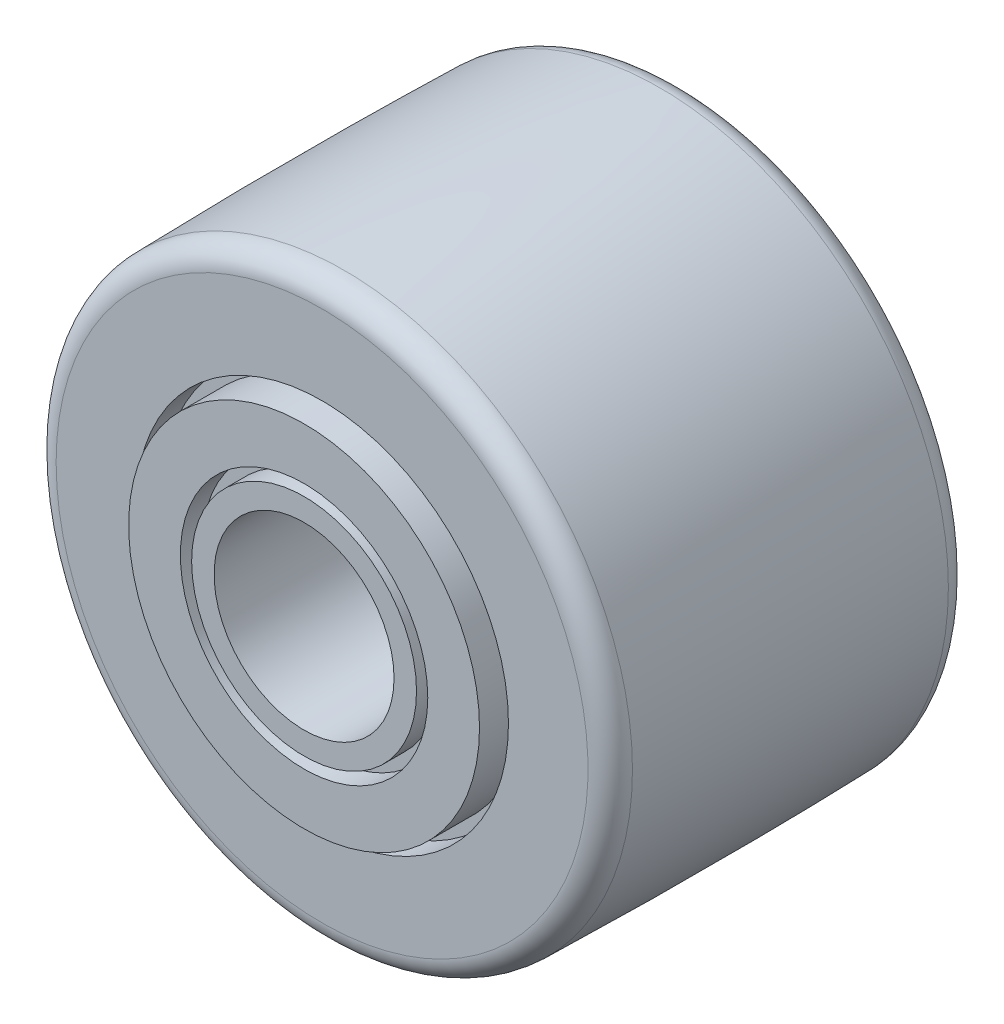
ISO-10303-21;
HEADER;
FILE_DESCRIPTION(('STEP AP214'),'2;1');
FILE_NAME('part.step','',(''),(''),'','','');
FILE_SCHEMA(('AUTOMOTIVE_DESIGN { 1 0 10303 214 1 1 1 1 }'));
ENDSEC;
DATA;
#1=APPLICATION_CONTEXT('core data for automotive mechanical design processes');
#2=APPLICATION_PROTOCOL_DEFINITION('international standard','automotive_design',2000,#1);
#3=PRODUCT_CONTEXT('',#1,'mechanical');
#4=PRODUCT('Part','Part','',(#3));
#5=PRODUCT_RELATED_PRODUCT_CATEGORY('part','',(#4));
#6=PRODUCT_DEFINITION_FORMATION('','',#4);
#7=PRODUCT_DEFINITION_CONTEXT('part definition',#1,'design');
#8=PRODUCT_DEFINITION('design','',#6,#7);
#9=PRODUCT_DEFINITION_SHAPE('','',#8);
#10=(LENGTH_UNIT() NAMED_UNIT(*) SI_UNIT(.MILLI.,.METRE.));
#11=(NAMED_UNIT(*) PLANE_ANGLE_UNIT() SI_UNIT($,.RADIAN.));
#12=(NAMED_UNIT(*) SI_UNIT($,.STERADIAN.) SOLID_ANGLE_UNIT());
#13=UNCERTAINTY_MEASURE_WITH_UNIT(LENGTH_MEASURE(1.E-05),#10,'distance_accuracy_value','');
#14=(GEOMETRIC_REPRESENTATION_CONTEXT(3) GLOBAL_UNCERTAINTY_ASSIGNED_CONTEXT((#13)) GLOBAL_UNIT_ASSIGNED_CONTEXT((#10,
#11,#12)) REPRESENTATION_CONTEXT('',''));
#15=CARTESIAN_POINT('',(0.,0.,0.));
#16=DIRECTION('',(0.,0.,1.));
#17=DIRECTION('',(1.,0.,0.));
#18=AXIS2_PLACEMENT_3D('',#15,#16,#17);
#19=CARTESIAN_POINT('',(0.,-12.7,-16.66875));
#20=DIRECTION('',(0.,0.,1.));
#21=DIRECTION('',(1.,0.,0.));
#22=AXIS2_PLACEMENT_3D('',#19,#20,#21);
#23=PLANE('',#22);
#24=CARTESIAN_POINT('',(0.,0.,-16.66875));
#25=DIRECTION('',(0.,0.,1.));
#26=DIRECTION('',(1.,0.,0.));
#27=AXIS2_PLACEMENT_3D('',#24,#25,#26);
#28=CIRCLE('',#27,11.7317845567516);
#29=CARTESIAN_POINT('',(11.7317845567516,0.,-16.66875));
#30=VERTEX_POINT('',#29);
#31=EDGE_CURVE('E43',#30,#30,#28,.F.);
#32=ORIENTED_EDGE('',*,*,#31,.T.);
#33=EDGE_LOOP('',(#32));
#34=FACE_BOUND('',#33,.T.);
#35=CARTESIAN_POINT('',(0.,0.,-16.66875));
#36=DIRECTION('',(0.,0.,1.));
#37=DIRECTION('',(1.,0.,0.));
#38=AXIS2_PLACEMENT_3D('',#35,#36,#37);
#39=CIRCLE('',#38,8.22275390625);
#40=CARTESIAN_POINT('',(8.22275390625,0.,-16.66875));
#41=VERTEX_POINT('',#40);
#42=EDGE_CURVE('E102',#41,#41,#39,.T.);
#43=ORIENTED_EDGE('',*,*,#42,.T.);
#44=EDGE_LOOP('',(#43));
#45=FACE_BOUND('',#44,.T.);
#46=ADVANCED_FACE('F36',(#34,#45),#23,.F.);
#47=CARTESIAN_POINT('',(0.,-7.7390625,-17.4625));
#48=DIRECTION('',(0.,0.,1.));
#49=DIRECTION('',(1.,0.,0.));
#50=AXIS2_PLACEMENT_3D('',#47,#48,#49);
#51=PLANE('',#50);
#52=CARTESIAN_POINT('',(0.,0.,-17.4625));
#53=DIRECTION('',(0.,0.,1.));
#54=DIRECTION('',(1.,0.,0.));
#55=AXIS2_PLACEMENT_3D('',#52,#53,#54);
#56=CIRCLE('',#55,7.7390625);
#57=CARTESIAN_POINT('',(7.7390625,0.,-17.4625));
#58=VERTEX_POINT('',#57);
#59=EDGE_CURVE('E59',#58,#58,#56,.T.);
#60=ORIENTED_EDGE('',*,*,#59,.F.);
#61=EDGE_LOOP('',(#60));
#62=FACE_BOUND('',#61,.T.);
#63=CARTESIAN_POINT('',(0.,0.,-17.4625));
#64=DIRECTION('',(0.,0.,1.));
#65=DIRECTION('',(1.,0.,0.));
#66=AXIS2_PLACEMENT_3D('',#63,#64,#65);
#67=CIRCLE('',#66,5.45703125);
#68=CARTESIAN_POINT('',(5.45703125,0.,-17.4625));
#69=VERTEX_POINT('',#68);
#70=EDGE_CURVE('E90',#69,#69,#67,.T.);
#71=ORIENTED_EDGE('',*,*,#70,.T.);
#72=EDGE_LOOP('',(#71));
#73=FACE_BOUND('',#72,.T.);
#74=ADVANCED_FACE('F131',(#62,#73),#51,.F.);
#75=CARTESIAN_POINT('',(0.,-7.7390625,0.));
#76=DIRECTION('',(0.,0.,-1.));
#77=DIRECTION('',(-1.,0.,0.));
#78=AXIS2_PLACEMENT_3D('',#75,#76,#77);
#79=PLANE('',#78);
#80=CARTESIAN_POINT('',(0.,0.,0.));
#81=DIRECTION('',(0.,0.,1.));
#82=DIRECTION('',(1.,0.,0.));
#83=AXIS2_PLACEMENT_3D('',#80,#81,#82);
#84=CIRCLE('',#83,3.96875);
#85=CARTESIAN_POINT('',(3.96875,0.,0.));
#86=VERTEX_POINT('',#85);
#87=EDGE_CURVE('E63',#86,#86,#84,.T.);
#88=ORIENTED_EDGE('',*,*,#87,.F.);
#89=EDGE_LOOP('',(#88));
#90=FACE_BOUND('',#89,.T.);
#91=CARTESIAN_POINT('',(0.,0.,0.));
#92=DIRECTION('',(0.,0.,1.));
#93=DIRECTION('',(1.,0.,0.));
#94=AXIS2_PLACEMENT_3D('',#91,#92,#93);
#95=CIRCLE('',#94,4.9609375);
#96=CARTESIAN_POINT('',(4.9609375,0.,0.));
#97=VERTEX_POINT('',#96);
#98=EDGE_CURVE('E75',#97,#97,#95,.T.);
#99=ORIENTED_EDGE('',*,*,#98,.T.);
#100=EDGE_LOOP('',(#99));
#101=FACE_BOUND('',#100,.T.);
#102=ADVANCED_FACE('F135',(#90,#101),#79,.F.);
#103=CARTESIAN_POINT('',(0.,0.,-17.4625));
#104=DIRECTION('',(0.,0.,1.));
#105=DIRECTION('',(1.,0.,0.));
#106=AXIS2_PLACEMENT_3D('',#103,#104,#105);
#107=CIRCLE('',#106,4.9609375);
#108=CARTESIAN_POINT('',(4.9609375,0.,-17.4625));
#109=VERTEX_POINT('',#108);
#110=EDGE_CURVE('E96',#109,#109,#107,.T.);
#111=ORIENTED_EDGE('',*,*,#110,.F.);
#112=EDGE_LOOP('',(#111));
#113=FACE_BOUND('',#112,.T.);
#114=CARTESIAN_POINT('',(0.,0.,-17.4625));
#115=DIRECTION('',(0.,0.,1.));
#116=DIRECTION('',(1.,0.,0.));
#117=AXIS2_PLACEMENT_3D('',#114,#115,#116);
#118=CIRCLE('',#117,3.96875);
#119=CARTESIAN_POINT('',(3.96875,0.,-17.4625));
#120=VERTEX_POINT('',#119);
#121=EDGE_CURVE('E62',#120,#120,#118,.T.);
#122=ORIENTED_EDGE('',*,*,#121,.T.);
#123=EDGE_LOOP('',(#122));
#124=FACE_BOUND('',#123,.T.);
#125=ADVANCED_FACE('F138',(#113,#124),#51,.F.);
#126=CARTESIAN_POINT('',(0.,0.,0.));
#127=DIRECTION('',(0.,0.,1.));
#128=DIRECTION('',(1.,0.,0.));
#129=AXIS2_PLACEMENT_3D('',#126,#127,#128);
#130=CIRCLE('',#129,5.45703125);
#131=CARTESIAN_POINT('',(5.45703125,0.,0.));
#132=VERTEX_POINT('',#131);
#133=EDGE_CURVE('E69',#132,#132,#130,.T.);
#134=ORIENTED_EDGE('',*,*,#133,.F.);
#135=EDGE_LOOP('',(#134));
#136=FACE_BOUND('',#135,.T.);
#137=CARTESIAN_POINT('',(0.,0.,0.));
#138=DIRECTION('',(0.,0.,1.));
#139=DIRECTION('',(1.,0.,0.));
#140=AXIS2_PLACEMENT_3D('',#137,#138,#139);
#141=CIRCLE('',#140,7.7390625);
#142=CARTESIAN_POINT('',(7.7390625,0.,0.));
#143=VERTEX_POINT('',#142);
#144=EDGE_CURVE('E56',#143,#143,#141,.T.);
#145=ORIENTED_EDGE('',*,*,#144,.T.);
#146=EDGE_LOOP('',(#145));
#147=FACE_BOUND('',#146,.T.);
#148=ADVANCED_FACE('F146',(#136,#147),#79,.F.);
#149=CARTESIAN_POINT('',(0.,0.,0.));
#150=DIRECTION('',(0.,0.,1.));
#151=DIRECTION('',(1.,0.,0.));
#152=AXIS2_PLACEMENT_3D('',#149,#150,#151);
#153=CYLINDRICAL_SURFACE('',#152,7.7390625);
#154=ORIENTED_EDGE('',*,*,#144,.F.);
#155=EDGE_LOOP('',(#154));
#156=FACE_BOUND('',#155,.T.);
#157=CARTESIAN_POINT('',(0.,0.,-1.984375));
#158=DIRECTION('',(0.,0.,1.));
#159=DIRECTION('',(1.,0.,0.));
#160=AXIS2_PLACEMENT_3D('',#157,#158,#159);
#161=CIRCLE('',#160,7.7390625);
#162=CARTESIAN_POINT('',(7.7390625,0.,-1.984375));
#163=VERTEX_POINT('',#162);
#164=EDGE_CURVE('E84',#163,#163,#161,.T.);
#165=ORIENTED_EDGE('',*,*,#164,.T.);
#166=EDGE_LOOP('',(#165));
#167=FACE_BOUND('',#166,.T.);
#168=ADVANCED_FACE('F143',(#156,#167),#153,.T.);
#169=CARTESIAN_POINT('',(0.,-12.7,-0.793750000000003));
#170=DIRECTION('',(0.,0.,-1.));
#171=DIRECTION('',(-1.,0.,0.));
#172=AXIS2_PLACEMENT_3D('',#169,#170,#171);
#173=PLANE('',#172);
#174=CARTESIAN_POINT('',(0.,0.,-0.793750000000003));
#175=DIRECTION('',(0.,0.,-1.));
#176=DIRECTION('',(-1.,0.,0.));
#177=AXIS2_PLACEMENT_3D('',#174,#175,#176);
#178=CIRCLE('',#177,11.7317845567516);
#179=CARTESIAN_POINT('',(-11.7317845567516,0.,-0.793750000000003));
#180=VERTEX_POINT('',#179);
#181=EDGE_CURVE('E10',#180,#180,#178,.F.);
#182=ORIENTED_EDGE('',*,*,#181,.T.);
#183=EDGE_LOOP('',(#182));
#184=FACE_BOUND('',#183,.T.);
#185=CARTESIAN_POINT('',(0.,0.,-0.793750000000003));
#186=DIRECTION('',(0.,0.,1.));
#187=DIRECTION('',(1.,0.,0.));
#188=AXIS2_PLACEMENT_3D('',#185,#186,#187);
#189=CIRCLE('',#188,8.22275390625);
#190=CARTESIAN_POINT('',(8.22275390625,0.,-0.793750000000003));
#191=VERTEX_POINT('',#190);
#192=EDGE_CURVE('E81',#191,#191,#189,.T.);
#193=ORIENTED_EDGE('',*,*,#192,.F.);
#194=EDGE_LOOP('',(#193));
#195=FACE_BOUND('',#194,.T.);
#196=ADVANCED_FACE('F126',(#184,#195),#173,.F.);
#197=CARTESIAN_POINT('',(0.,0.,-8.73125));
#198=DIRECTION('',(0.,0.,1.));
#199=DIRECTION('',(1.,0.,0.));
#200=AXIS2_PLACEMENT_3D('',#197,#198,#199);
#201=DEGENERATE_TOROIDAL_SURFACE('',#200,291.996629606811,304.8,.F.);
#202=CARTESIAN_POINT('',(0.,0.,-15.6992447746571));
#203=DIRECTION('',(0.,0.,1.));
#204=DIRECTION('',(1.,0.,0.));
#205=AXIS2_PLACEMENT_3D('',#202,#203,#204);
#206=CIRCLE('',#205,12.7237127545425);
#207=CARTESIAN_POINT('',(12.7237127545425,0.,-15.6992447746571));
#208=VERTEX_POINT('',#207);
#209=EDGE_CURVE('E47',#208,#208,#206,.T.);
#210=ORIENTED_EDGE('',*,*,#209,.T.);
#211=EDGE_LOOP('',(#210));
#212=FACE_BOUND('',#211,.T.);
#213=CARTESIAN_POINT('',(0.,0.,-1.76325522534292));
#214=DIRECTION('',(0.,0.,-1.));
#215=DIRECTION('',(-1.,0.,0.));
#216=AXIS2_PLACEMENT_3D('',#213,#214,#215);
#217=CIRCLE('',#216,12.7237127545425);
#218=CARTESIAN_POINT('',(-12.7237127545425,0.,-1.76325522534292));
#219=VERTEX_POINT('',#218);
#220=EDGE_CURVE('E51',#219,#219,#217,.T.);
#221=ORIENTED_EDGE('',*,*,#220,.T.);
#222=EDGE_LOOP('',(#221));
#223=FACE_BOUND('',#222,.T.);
#224=ADVANCED_FACE('F116',(#212,#223),#201,.F.);
#225=CARTESIAN_POINT('',(0.,0.,0.));
#226=DIRECTION('',(0.,0.,1.));
#227=DIRECTION('',(1.,0.,0.));
#228=AXIS2_PLACEMENT_3D('',#225,#226,#227);
#229=CYLINDRICAL_SURFACE('',#228,7.7390625);
#230=ORIENTED_EDGE('',*,*,#59,.T.);
#231=EDGE_LOOP('',(#230));
#232=FACE_BOUND('',#231,.T.);
#233=CARTESIAN_POINT('',(0.,0.,-15.478125));
#234=DIRECTION('',(0.,0.,1.));
#235=DIRECTION('',(1.,0.,0.));
#236=AXIS2_PLACEMENT_3D('',#233,#234,#235);
#237=CIRCLE('',#236,7.7390625);
#238=CARTESIAN_POINT('',(7.7390625,0.,-15.478125));
#239=VERTEX_POINT('',#238);
#240=EDGE_CURVE('E105',#239,#239,#237,.T.);
#241=ORIENTED_EDGE('',*,*,#240,.F.);
#242=EDGE_LOOP('',(#241));
#243=FACE_BOUND('',#242,.T.);
#244=ADVANCED_FACE('F113',(#232,#243),#229,.T.);
#245=CARTESIAN_POINT('',(0.,0.,-17.4625));
#246=DIRECTION('',(0.,0.,1.));
#247=DIRECTION('',(1.,0.,0.));
#248=AXIS2_PLACEMENT_3D('',#245,#246,#247);
#249=CYLINDRICAL_SURFACE('',#248,3.96875);
#250=ORIENTED_EDGE('',*,*,#121,.F.);
#251=EDGE_LOOP('',(#250));
#252=FACE_BOUND('',#251,.T.);
#253=ORIENTED_EDGE('',*,*,#87,.T.);
#254=EDGE_LOOP('',(#253));
#255=FACE_BOUND('',#254,.T.);
#256=ADVANCED_FACE('F115',(#252,#255),#249,.F.);
#257=CARTESIAN_POINT('',(0.,0.,-0.9921875));
#258=DIRECTION('',(0.,0.,1.));
#259=DIRECTION('',(1.,0.,0.));
#260=AXIS2_PLACEMENT_3D('',#257,#258,#259);
#261=CYLINDRICAL_SURFACE('',#260,5.45703125);
#262=CARTESIAN_POINT('',(0.,0.,-0.9921875));
#263=DIRECTION('',(0.,0.,1.));
#264=DIRECTION('',(1.,0.,0.));
#265=AXIS2_PLACEMENT_3D('',#262,#263,#264);
#266=CIRCLE('',#265,5.45703125);
#267=CARTESIAN_POINT('',(5.45703125,0.,-0.9921875));
#268=VERTEX_POINT('',#267);
#269=EDGE_CURVE('E66',#268,#268,#266,.T.);
#270=ORIENTED_EDGE('',*,*,#269,.F.);
#271=EDGE_LOOP('',(#270));
#272=FACE_BOUND('',#271,.T.);
#273=ORIENTED_EDGE('',*,*,#133,.T.);
#274=EDGE_LOOP('',(#273));
#275=FACE_BOUND('',#274,.T.);
#276=ADVANCED_FACE('F123',(#272,#275),#261,.F.);
#277=CARTESIAN_POINT('',(0.,0.,-0.9921875));
#278=DIRECTION('',(0.,0.,1.));
#279=DIRECTION('',(1.,0.,0.));
#280=AXIS2_PLACEMENT_3D('',#277,#278,#279);
#281=PLANE('',#280);
#282=CARTESIAN_POINT('',(0.,0.,-0.9921875));
#283=DIRECTION('',(0.,0.,1.));
#284=DIRECTION('',(1.,0.,0.));
#285=AXIS2_PLACEMENT_3D('',#282,#283,#284);
#286=CIRCLE('',#285,4.9609375);
#287=CARTESIAN_POINT('',(4.9609375,0.,-0.9921875));
#288=VERTEX_POINT('',#287);
#289=EDGE_CURVE('E72',#288,#288,#286,.T.);
#290=ORIENTED_EDGE('',*,*,#289,.F.);
#291=EDGE_LOOP('',(#290));
#292=FACE_BOUND('',#291,.T.);
#293=ORIENTED_EDGE('',*,*,#269,.T.);
#294=EDGE_LOOP('',(#293));
#295=FACE_BOUND('',#294,.T.);
#296=ADVANCED_FACE('F184',(#292,#295),#281,.T.);
#297=CARTESIAN_POINT('',(0.,0.,-0.9921875));
#298=DIRECTION('',(0.,0.,1.));
#299=DIRECTION('',(1.,0.,0.));
#300=AXIS2_PLACEMENT_3D('',#297,#298,#299);
#301=CYLINDRICAL_SURFACE('',#300,4.9609375);
#302=ORIENTED_EDGE('',*,*,#289,.T.);
#303=EDGE_LOOP('',(#302));
#304=FACE_BOUND('',#303,.T.);
#305=ORIENTED_EDGE('',*,*,#98,.F.);
#306=EDGE_LOOP('',(#305));
#307=FACE_BOUND('',#306,.T.);
#308=ADVANCED_FACE('F173',(#304,#307),#301,.T.);
#309=CARTESIAN_POINT('',(0.,0.,-1.984375));
#310=DIRECTION('',(0.,0.,1.));
#311=DIRECTION('',(1.,0.,0.));
#312=AXIS2_PLACEMENT_3D('',#309,#310,#311);
#313=CYLINDRICAL_SURFACE('',#312,8.22275390625);
#314=CARTESIAN_POINT('',(0.,0.,-1.984375));
#315=DIRECTION('',(0.,0.,1.));
#316=DIRECTION('',(1.,0.,0.));
#317=AXIS2_PLACEMENT_3D('',#314,#315,#316);
#318=CIRCLE('',#317,8.22275390625);
#319=CARTESIAN_POINT('',(8.22275390625,0.,-1.984375));
#320=VERTEX_POINT('',#319);
#321=EDGE_CURVE('E78',#320,#320,#318,.T.);
#322=ORIENTED_EDGE('',*,*,#321,.F.);
#323=EDGE_LOOP('',(#322));
#324=FACE_BOUND('',#323,.T.);
#325=ORIENTED_EDGE('',*,*,#192,.T.);
#326=EDGE_LOOP('',(#325));
#327=FACE_BOUND('',#326,.T.);
#328=ADVANCED_FACE('F162',(#324,#327),#313,.F.);
#329=CARTESIAN_POINT('',(0.,0.,-1.984375));
#330=DIRECTION('',(0.,0.,1.));
#331=DIRECTION('',(1.,0.,0.));
#332=AXIS2_PLACEMENT_3D('',#329,#330,#331);
#333=PLANE('',#332);
#334=ORIENTED_EDGE('',*,*,#164,.F.);
#335=EDGE_LOOP('',(#334));
#336=FACE_BOUND('',#335,.T.);
#337=ORIENTED_EDGE('',*,*,#321,.T.);
#338=EDGE_LOOP('',(#337));
#339=FACE_BOUND('',#338,.T.);
#340=ADVANCED_FACE('F154',(#336,#339),#333,.T.);
#341=CARTESIAN_POINT('',(0.,0.,-15.6765625));
#342=DIRECTION('',(0.,0.,1.));
#343=DIRECTION('',(1.,0.,0.));
#344=AXIS2_PLACEMENT_3D('',#341,#342,#343);
#345=TOROIDAL_SURFACE('',#344,11.7317845567516,0.9921875);
#346=ORIENTED_EDGE('',*,*,#31,.F.);
#347=EDGE_LOOP('',(#346));
#348=FACE_BOUND('',#347,.T.);
#349=ORIENTED_EDGE('',*,*,#209,.F.);
#350=EDGE_LOOP('',(#349));
#351=FACE_BOUND('',#350,.T.);
#352=ADVANCED_FACE('F152',(#348,#351),#345,.T.);
#353=CARTESIAN_POINT('',(0.,0.,-1.7859375));
#354=DIRECTION('',(0.,0.,-1.));
#355=DIRECTION('',(-1.,0.,0.));
#356=AXIS2_PLACEMENT_3D('',#353,#354,#355);
#357=TOROIDAL_SURFACE('',#356,11.7317845567516,0.9921875);
#358=ORIENTED_EDGE('',*,*,#220,.F.);
#359=EDGE_LOOP('',(#358));
#360=FACE_BOUND('',#359,.T.);
#361=ORIENTED_EDGE('',*,*,#181,.F.);
#362=EDGE_LOOP('',(#361));
#363=FACE_BOUND('',#362,.T.);
#364=ADVANCED_FACE('F38',(#360,#363),#357,.T.);
#365=CARTESIAN_POINT('',(0.,0.,-16.4703125));
#366=DIRECTION('',(0.,0.,-1.));
#367=DIRECTION('',(1.,0.,0.));
#368=AXIS2_PLACEMENT_3D('',#365,#366,#367);
#369=PLANE('',#368);
#370=CARTESIAN_POINT('',(0.,0.,-16.4703125));
#371=DIRECTION('',(0.,0.,1.));
#372=DIRECTION('',(1.,0.,0.));
#373=AXIS2_PLACEMENT_3D('',#370,#371,#372);
#374=CIRCLE('',#373,5.45703125);
#375=CARTESIAN_POINT('',(5.45703125,0.,-16.4703125));
#376=VERTEX_POINT('',#375);
#377=EDGE_CURVE('E89',#376,#376,#374,.T.);
#378=ORIENTED_EDGE('',*,*,#377,.F.);
#379=EDGE_LOOP('',(#378));
#380=FACE_BOUND('',#379,.T.);
#381=CARTESIAN_POINT('',(0.,0.,-16.4703125));
#382=DIRECTION('',(0.,0.,1.));
#383=DIRECTION('',(1.,0.,0.));
#384=AXIS2_PLACEMENT_3D('',#381,#382,#383);
#385=CIRCLE('',#384,4.9609375);
#386=CARTESIAN_POINT('',(4.9609375,0.,-16.4703125));
#387=VERTEX_POINT('',#386);
#388=EDGE_CURVE('E93',#387,#387,#385,.T.);
#389=ORIENTED_EDGE('',*,*,#388,.T.);
#390=EDGE_LOOP('',(#389));
#391=FACE_BOUND('',#390,.T.);
#392=ADVANCED_FACE('F160',(#380,#391),#369,.T.);
#393=CARTESIAN_POINT('',(0.,0.,-16.4703125));
#394=DIRECTION('',(0.,0.,-1.));
#395=DIRECTION('',(-1.,0.,0.));
#396=AXIS2_PLACEMENT_3D('',#393,#394,#395);
#397=CYLINDRICAL_SURFACE('',#396,5.45703125);
#398=ORIENTED_EDGE('',*,*,#377,.T.);
#399=EDGE_LOOP('',(#398));
#400=FACE_BOUND('',#399,.T.);
#401=ORIENTED_EDGE('',*,*,#70,.F.);
#402=EDGE_LOOP('',(#401));
#403=FACE_BOUND('',#402,.T.);
#404=ADVANCED_FACE('F179',(#400,#403),#397,.F.);
#405=CARTESIAN_POINT('',(0.,0.,-16.4703125));
#406=DIRECTION('',(0.,0.,-1.));
#407=DIRECTION('',(-1.,0.,0.));
#408=AXIS2_PLACEMENT_3D('',#405,#406,#407);
#409=CYLINDRICAL_SURFACE('',#408,4.9609375);
#410=ORIENTED_EDGE('',*,*,#388,.F.);
#411=EDGE_LOOP('',(#410));
#412=FACE_BOUND('',#411,.T.);
#413=ORIENTED_EDGE('',*,*,#110,.T.);
#414=EDGE_LOOP('',(#413));
#415=FACE_BOUND('',#414,.T.);
#416=ADVANCED_FACE('F288',(#412,#415),#409,.T.);
#417=CARTESIAN_POINT('',(0.,0.,-15.478125));
#418=DIRECTION('',(0.,0.,-1.));
#419=DIRECTION('',(1.,0.,0.));
#420=AXIS2_PLACEMENT_3D('',#417,#418,#419);
#421=PLANE('',#420);
#422=CARTESIAN_POINT('',(0.,0.,-15.478125));
#423=DIRECTION('',(0.,0.,1.));
#424=DIRECTION('',(1.,0.,0.));
#425=AXIS2_PLACEMENT_3D('',#422,#423,#424);
#426=CIRCLE('',#425,8.22275390625);
#427=CARTESIAN_POINT('',(8.22275390625,0.,-15.478125));
#428=VERTEX_POINT('',#427);
#429=EDGE_CURVE('E99',#428,#428,#426,.T.);
#430=ORIENTED_EDGE('',*,*,#429,.F.);
#431=EDGE_LOOP('',(#430));
#432=FACE_BOUND('',#431,.T.);
#433=ORIENTED_EDGE('',*,*,#240,.T.);
#434=EDGE_LOOP('',(#433));
#435=FACE_BOUND('',#434,.T.);
#436=ADVANCED_FACE('F111',(#432,#435),#421,.T.);
#437=CARTESIAN_POINT('',(0.,0.,-15.478125));
#438=DIRECTION('',(0.,0.,-1.));
#439=DIRECTION('',(-1.,0.,0.));
#440=AXIS2_PLACEMENT_3D('',#437,#438,#439);
#441=CYLINDRICAL_SURFACE('',#440,8.22275390625);
#442=ORIENTED_EDGE('',*,*,#429,.T.);
#443=EDGE_LOOP('',(#442));
#444=FACE_BOUND('',#443,.T.);
#445=ORIENTED_EDGE('',*,*,#42,.F.);
#446=EDGE_LOOP('',(#445));
#447=FACE_BOUND('',#446,.T.);
#448=ADVANCED_FACE('F307',(#444,#447),#441,.F.);
#449=CLOSED_SHELL('',(#46,#74,#102,#125,#148,#168,#196,#224,#244,#256,#276,#296,#308,#328,#340,
#352,#364,#392,#404,#416,#436,#448));
#450=MANIFOLD_SOLID_BREP('B2',#449);
#451=ADVANCED_BREP_SHAPE_REPRESENTATION('',(#18,#450),#14);
#452=SHAPE_DEFINITION_REPRESENTATION(#9,#451);
ENDSEC;
END-ISO-10303-21;
